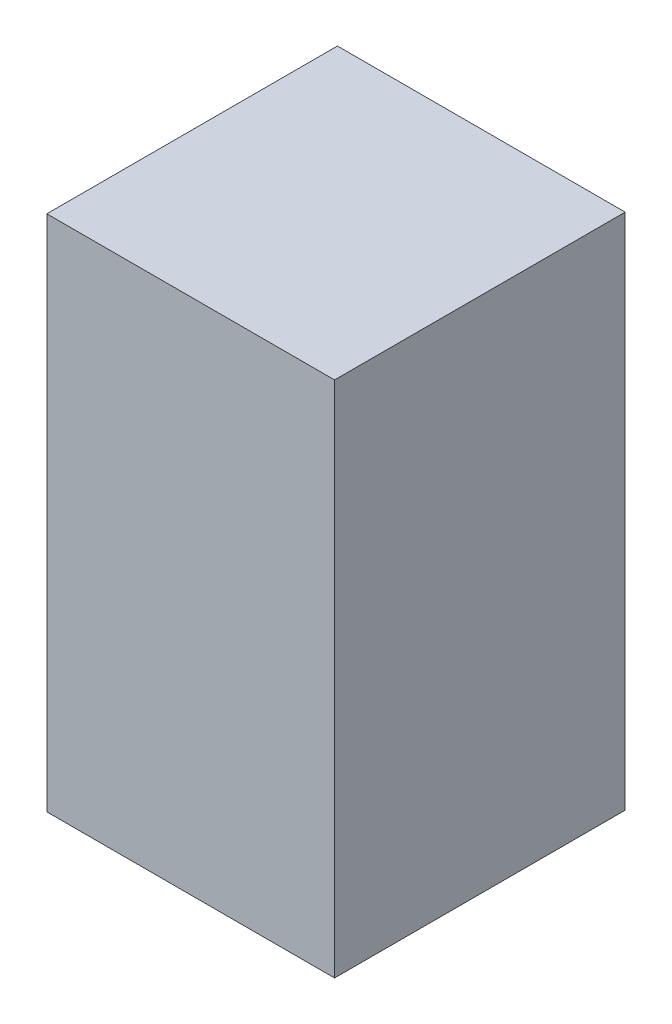
ISO-10303-21;
HEADER;
FILE_DESCRIPTION(('STEP AP214'),'2;1');
FILE_NAME('part.step','',(''),(''),'','','');
FILE_SCHEMA(('AUTOMOTIVE_DESIGN { 1 0 10303 214 1 1 1 1 }'));
ENDSEC;
DATA;
#1=APPLICATION_CONTEXT('core data for automotive mechanical design processes');
#2=APPLICATION_PROTOCOL_DEFINITION('international standard','automotive_design',2000,#1);
#3=PRODUCT_CONTEXT('',#1,'mechanical');
#4=PRODUCT('Part','Part','',(#3));
#5=PRODUCT_RELATED_PRODUCT_CATEGORY('part','',(#4));
#6=PRODUCT_DEFINITION_FORMATION('','',#4);
#7=PRODUCT_DEFINITION_CONTEXT('part definition',#1,'design');
#8=PRODUCT_DEFINITION('design','',#6,#7);
#9=PRODUCT_DEFINITION_SHAPE('','',#8);
#10=(LENGTH_UNIT() NAMED_UNIT(*) SI_UNIT(.MILLI.,.METRE.));
#11=(NAMED_UNIT(*) PLANE_ANGLE_UNIT() SI_UNIT($,.RADIAN.));
#12=(NAMED_UNIT(*) SI_UNIT($,.STERADIAN.) SOLID_ANGLE_UNIT());
#13=UNCERTAINTY_MEASURE_WITH_UNIT(LENGTH_MEASURE(1.E-05),#10,'distance_accuracy_value','');
#14=(GEOMETRIC_REPRESENTATION_CONTEXT(3) GLOBAL_UNCERTAINTY_ASSIGNED_CONTEXT((#13)) GLOBAL_UNIT_ASSIGNED_CONTEXT((#10,
#11,#12)) REPRESENTATION_CONTEXT('',''));
#15=CARTESIAN_POINT('',(0.,0.,0.));
#16=DIRECTION('',(0.,0.,1.));
#17=DIRECTION('',(1.,0.,0.));
#18=AXIS2_PLACEMENT_3D('',#15,#16,#17);
#19=CARTESIAN_POINT('',(-15.,-27.,30.3));
#20=DIRECTION('',(1.,0.,0.));
#21=DIRECTION('',(0.,0.,-1.));
#22=AXIS2_PLACEMENT_3D('',#19,#20,#21);
#23=PLANE('',#22);
#24=DIRECTION('',(0.,-1.,0.));
#25=VECTOR('',#24,1.);
#26=CARTESIAN_POINT('',(-15.,-27.,0.));
#27=LINE('',#26,#25);
#28=CARTESIAN_POINT('',(-15.,27.,0.));
#29=VERTEX_POINT('',#28);
#30=CARTESIAN_POINT('',(-15.,-27.,0.));
#31=VERTEX_POINT('',#30);
#32=EDGE_CURVE('E98',#29,#31,#27,.T.);
#33=ORIENTED_EDGE('',*,*,#32,.T.);
#34=DIRECTION('',(0.,0.,-1.));
#35=VECTOR('',#34,1.);
#36=CARTESIAN_POINT('',(-15.,-27.,30.3));
#37=LINE('',#36,#35);
#38=CARTESIAN_POINT('',(-15.,-27.,30.3));
#39=VERTEX_POINT('',#38);
#40=EDGE_CURVE('E11',#39,#31,#37,.T.);
#41=ORIENTED_EDGE('',*,*,#40,.F.);
#42=DIRECTION('',(0.,-1.,0.));
#43=VECTOR('',#42,1.);
#44=CARTESIAN_POINT('',(-15.,-27.,30.3));
#45=LINE('',#44,#43);
#46=CARTESIAN_POINT('',(-15.,27.,30.3));
#47=VERTEX_POINT('',#46);
#48=EDGE_CURVE('E86',#47,#39,#45,.T.);
#49=ORIENTED_EDGE('',*,*,#48,.F.);
#50=DIRECTION('',(0.,0.,-1.));
#51=VECTOR('',#50,1.);
#52=CARTESIAN_POINT('',(-15.,27.,30.3));
#53=LINE('',#52,#51);
#54=EDGE_CURVE('E94',#47,#29,#53,.T.);
#55=ORIENTED_EDGE('',*,*,#54,.T.);
#56=EDGE_LOOP('',(#33,#41,#49,#55));
#57=FACE_BOUND('',#56,.T.);
#58=ADVANCED_FACE('F35',(#57),#23,.F.);
#59=CARTESIAN_POINT('',(-15.,-27.,30.3));
#60=DIRECTION('',(0.,1.,0.));
#61=DIRECTION('',(0.,0.,1.));
#62=AXIS2_PLACEMENT_3D('',#59,#60,#61);
#63=PLANE('',#62);
#64=DIRECTION('',(1.,0.,0.));
#65=VECTOR('',#64,1.);
#66=CARTESIAN_POINT('',(-15.,-27.,0.));
#67=LINE('',#66,#65);
#68=CARTESIAN_POINT('',(15.,-27.,0.));
#69=VERTEX_POINT('',#68);
#70=EDGE_CURVE('E90',#31,#69,#67,.T.);
#71=ORIENTED_EDGE('',*,*,#70,.T.);
#72=DIRECTION('',(0.,0.,-1.));
#73=VECTOR('',#72,1.);
#74=CARTESIAN_POINT('',(15.,-27.,30.3));
#75=LINE('',#74,#73);
#76=CARTESIAN_POINT('',(15.,-27.,30.3));
#77=VERTEX_POINT('',#76);
#78=EDGE_CURVE('E43',#77,#69,#75,.T.);
#79=ORIENTED_EDGE('',*,*,#78,.F.);
#80=DIRECTION('',(1.,0.,0.));
#81=VECTOR('',#80,1.);
#82=CARTESIAN_POINT('',(-15.,-27.,30.3));
#83=LINE('',#82,#81);
#84=EDGE_CURVE('E81',#39,#77,#83,.T.);
#85=ORIENTED_EDGE('',*,*,#84,.F.);
#86=ORIENTED_EDGE('',*,*,#40,.T.);
#87=EDGE_LOOP('',(#71,#79,#85,#86));
#88=FACE_BOUND('',#87,.T.);
#89=ADVANCED_FACE('F89',(#88),#63,.F.);
#90=CARTESIAN_POINT('',(15.,-27.,30.3));
#91=DIRECTION('',(-1.,0.,0.));
#92=DIRECTION('',(0.,0.,1.));
#93=AXIS2_PLACEMENT_3D('',#90,#91,#92);
#94=PLANE('',#93);
#95=DIRECTION('',(0.,1.,0.));
#96=VECTOR('',#95,1.);
#97=CARTESIAN_POINT('',(15.,-27.,0.));
#98=LINE('',#97,#96);
#99=CARTESIAN_POINT('',(15.,27.,0.));
#100=VERTEX_POINT('',#99);
#101=EDGE_CURVE('E68',#69,#100,#98,.T.);
#102=ORIENTED_EDGE('',*,*,#101,.T.);
#103=DIRECTION('',(0.,0.,-1.));
#104=VECTOR('',#103,1.);
#105=CARTESIAN_POINT('',(15.,27.,30.3));
#106=LINE('',#105,#104);
#107=CARTESIAN_POINT('',(15.,27.,30.3));
#108=VERTEX_POINT('',#107);
#109=EDGE_CURVE('E91',#108,#100,#106,.T.);
#110=ORIENTED_EDGE('',*,*,#109,.F.);
#111=DIRECTION('',(0.,1.,0.));
#112=VECTOR('',#111,1.);
#113=CARTESIAN_POINT('',(15.,-27.,30.3));
#114=LINE('',#113,#112);
#115=EDGE_CURVE('E84',#77,#108,#114,.T.);
#116=ORIENTED_EDGE('',*,*,#115,.F.);
#117=ORIENTED_EDGE('',*,*,#78,.T.);
#118=EDGE_LOOP('',(#102,#110,#116,#117));
#119=FACE_BOUND('',#118,.T.);
#120=ADVANCED_FACE('F92',(#119),#94,.F.);
#121=CARTESIAN_POINT('',(-15.,27.,30.3));
#122=DIRECTION('',(0.,-1.,0.));
#123=DIRECTION('',(0.,0.,-1.));
#124=AXIS2_PLACEMENT_3D('',#121,#122,#123);
#125=PLANE('',#124);
#126=DIRECTION('',(-1.,0.,0.));
#127=VECTOR('',#126,1.);
#128=CARTESIAN_POINT('',(-15.,27.,0.));
#129=LINE('',#128,#127);
#130=EDGE_CURVE('E74',#100,#29,#129,.T.);
#131=ORIENTED_EDGE('',*,*,#130,.T.);
#132=ORIENTED_EDGE('',*,*,#54,.F.);
#133=DIRECTION('',(-1.,0.,0.));
#134=VECTOR('',#133,1.);
#135=CARTESIAN_POINT('',(-15.,27.,30.3));
#136=LINE('',#135,#134);
#137=EDGE_CURVE('E51',#108,#47,#136,.T.);
#138=ORIENTED_EDGE('',*,*,#137,.F.);
#139=ORIENTED_EDGE('',*,*,#109,.T.);
#140=EDGE_LOOP('',(#131,#132,#138,#139));
#141=FACE_BOUND('',#140,.T.);
#142=ADVANCED_FACE('F105',(#141),#125,.F.);
#143=CARTESIAN_POINT('',(0.,0.,30.3));
#144=DIRECTION('',(0.,0.,-1.));
#145=DIRECTION('',(-1.,0.,0.));
#146=AXIS2_PLACEMENT_3D('',#143,#144,#145);
#147=PLANE('',#146);
#148=ORIENTED_EDGE('',*,*,#48,.T.);
#149=ORIENTED_EDGE('',*,*,#84,.T.);
#150=ORIENTED_EDGE('',*,*,#115,.T.);
#151=ORIENTED_EDGE('',*,*,#137,.T.);
#152=EDGE_LOOP('',(#148,#149,#150,#151));
#153=FACE_BOUND('',#152,.T.);
#154=ADVANCED_FACE('F82',(#153),#147,.F.);
#155=CARTESIAN_POINT('',(0.,0.,0.));
#156=DIRECTION('',(0.,0.,-1.));
#157=DIRECTION('',(-1.,0.,0.));
#158=AXIS2_PLACEMENT_3D('',#155,#156,#157);
#159=PLANE('',#158);
#160=ORIENTED_EDGE('',*,*,#32,.F.);
#161=ORIENTED_EDGE('',*,*,#130,.F.);
#162=ORIENTED_EDGE('',*,*,#101,.F.);
#163=ORIENTED_EDGE('',*,*,#70,.F.);
#164=EDGE_LOOP('',(#160,#161,#162,#163));
#165=FACE_BOUND('',#164,.T.);
#166=ADVANCED_FACE('F108',(#165),#159,.T.);
#167=CLOSED_SHELL('',(#58,#89,#120,#142,#154,#166));
#168=MANIFOLD_SOLID_BREP('B2',#167);
#169=ADVANCED_BREP_SHAPE_REPRESENTATION('',(#18,#168),#14);
#170=SHAPE_DEFINITION_REPRESENTATION(#9,#169);
ENDSEC;
END-ISO-10303-21;
